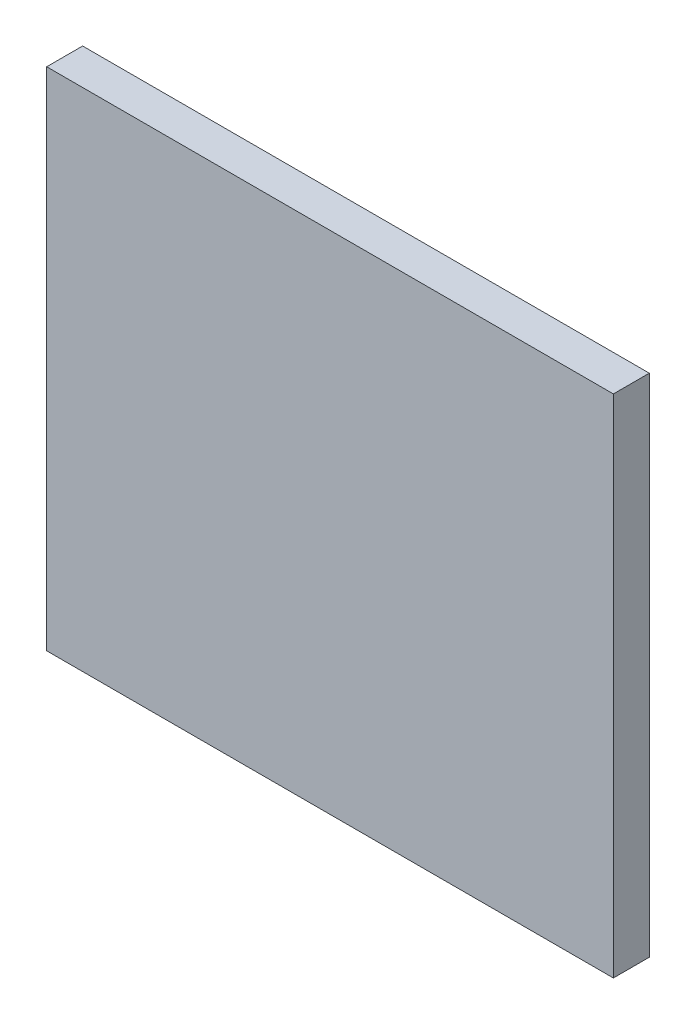
ISO-10303-21;
HEADER;
FILE_DESCRIPTION(('STEP AP214'),'2;1');
FILE_NAME('part.step','',(''),(''),'','','');
FILE_SCHEMA(('AUTOMOTIVE_DESIGN { 1 0 10303 214 1 1 1 1 }'));
ENDSEC;
DATA;
#1=APPLICATION_CONTEXT('core data for automotive mechanical design processes');
#2=APPLICATION_PROTOCOL_DEFINITION('international standard','automotive_design',2000,#1);
#3=PRODUCT_CONTEXT('',#1,'mechanical');
#4=PRODUCT('Part','Part','',(#3));
#5=PRODUCT_RELATED_PRODUCT_CATEGORY('part','',(#4));
#6=PRODUCT_DEFINITION_FORMATION('','',#4);
#7=PRODUCT_DEFINITION_CONTEXT('part definition',#1,'design');
#8=PRODUCT_DEFINITION('design','',#6,#7);
#9=PRODUCT_DEFINITION_SHAPE('','',#8);
#10=(LENGTH_UNIT() NAMED_UNIT(*) SI_UNIT(.MILLI.,.METRE.));
#11=(NAMED_UNIT(*) PLANE_ANGLE_UNIT() SI_UNIT($,.RADIAN.));
#12=(NAMED_UNIT(*) SI_UNIT($,.STERADIAN.) SOLID_ANGLE_UNIT());
#13=UNCERTAINTY_MEASURE_WITH_UNIT(LENGTH_MEASURE(1.E-05),#10,'distance_accuracy_value','');
#14=(GEOMETRIC_REPRESENTATION_CONTEXT(3) GLOBAL_UNCERTAINTY_ASSIGNED_CONTEXT((#13)) GLOBAL_UNIT_ASSIGNED_CONTEXT((#10,
#11,#12)) REPRESENTATION_CONTEXT('',''));
#15=CARTESIAN_POINT('',(0.,0.,0.));
#16=DIRECTION('',(0.,0.,1.));
#17=DIRECTION('',(1.,0.,0.));
#18=AXIS2_PLACEMENT_3D('',#15,#16,#17);
#19=CARTESIAN_POINT('',(-9.4615,8.4455,1.20000014));
#20=DIRECTION('',(0.,0.,1.));
#21=DIRECTION('',(1.,0.,0.));
#22=AXIS2_PLACEMENT_3D('',#19,#20,#21);
#23=PLANE('',#22);
#24=DIRECTION('',(0.,1.,0.));
#25=VECTOR('',#24,1.);
#26=CARTESIAN_POINT('',(9.4615,8.4455,1.20000014));
#27=LINE('',#26,#25);
#28=CARTESIAN_POINT('',(9.4615,8.4455,1.20000014));
#29=VERTEX_POINT('',#28);
#30=CARTESIAN_POINT('',(9.4615,-8.4455,1.20000014));
#31=VERTEX_POINT('',#30);
#32=EDGE_CURVE('E53',#29,#31,#27,.F.);
#33=ORIENTED_EDGE('',*,*,#32,.F.);
#34=DIRECTION('',(1.,0.,0.));
#35=VECTOR('',#34,1.);
#36=CARTESIAN_POINT('',(-9.4615,8.4455,1.20000014));
#37=LINE('',#36,#35);
#38=CARTESIAN_POINT('',(-9.4615,8.4455,1.20000014));
#39=VERTEX_POINT('',#38);
#40=EDGE_CURVE('E68',#39,#29,#37,.T.);
#41=ORIENTED_EDGE('',*,*,#40,.F.);
#42=DIRECTION('',(0.,1.,0.));
#43=VECTOR('',#42,1.);
#44=CARTESIAN_POINT('',(-9.4615,-8.4455,1.20000014));
#45=LINE('',#44,#43);
#46=CARTESIAN_POINT('',(-9.4615,-8.4455,1.20000014));
#47=VERTEX_POINT('',#46);
#48=EDGE_CURVE('E20',#47,#39,#45,.T.);
#49=ORIENTED_EDGE('',*,*,#48,.F.);
#50=DIRECTION('',(1.,0.,0.));
#51=VECTOR('',#50,1.);
#52=CARTESIAN_POINT('',(9.4615,-8.4455,1.20000014));
#53=LINE('',#52,#51);
#54=EDGE_CURVE('E58',#31,#47,#53,.F.);
#55=ORIENTED_EDGE('',*,*,#54,.F.);
#56=EDGE_LOOP('',(#33,#41,#49,#55));
#57=FACE_BOUND('',#56,.T.);
#58=ADVANCED_FACE('F17',(#57),#23,.T.);
#59=CARTESIAN_POINT('',(-9.4615,-8.4455,0.));
#60=DIRECTION('',(-1.,0.,0.));
#61=DIRECTION('',(0.,0.,1.));
#62=AXIS2_PLACEMENT_3D('',#59,#60,#61);
#63=PLANE('',#62);
#64=DIRECTION('',(0.,0.,1.));
#65=VECTOR('',#64,1.);
#66=CARTESIAN_POINT('',(-9.4615,8.4455,0.));
#67=LINE('',#66,#65);
#68=CARTESIAN_POINT('',(-9.4615,8.4455,0.));
#69=VERTEX_POINT('',#68);
#70=EDGE_CURVE('E79',#69,#39,#67,.T.);
#71=ORIENTED_EDGE('',*,*,#70,.F.);
#72=DIRECTION('',(0.,1.,0.));
#73=VECTOR('',#72,1.);
#74=CARTESIAN_POINT('',(-9.4615,8.4455,0.));
#75=LINE('',#74,#73);
#76=CARTESIAN_POINT('',(-9.4615,-8.4455,0.));
#77=VERTEX_POINT('',#76);
#78=EDGE_CURVE('E74',#69,#77,#75,.F.);
#79=ORIENTED_EDGE('',*,*,#78,.T.);
#80=DIRECTION('',(0.,0.,-1.));
#81=VECTOR('',#80,1.);
#82=CARTESIAN_POINT('',(-9.4615,-8.4455,0.));
#83=LINE('',#82,#81);
#84=EDGE_CURVE('E63',#47,#77,#83,.T.);
#85=ORIENTED_EDGE('',*,*,#84,.F.);
#86=ORIENTED_EDGE('',*,*,#48,.T.);
#87=EDGE_LOOP('',(#71,#79,#85,#86));
#88=FACE_BOUND('',#87,.T.);
#89=ADVANCED_FACE('F73',(#88),#63,.T.);
#90=CARTESIAN_POINT('',(9.4615,-8.4455,0.));
#91=DIRECTION('',(0.,-1.,0.));
#92=DIRECTION('',(0.,0.,-1.));
#93=AXIS2_PLACEMENT_3D('',#90,#91,#92);
#94=PLANE('',#93);
#95=ORIENTED_EDGE('',*,*,#84,.T.);
#96=DIRECTION('',(1.,0.,0.));
#97=VECTOR('',#96,1.);
#98=CARTESIAN_POINT('',(-9.4615,-8.4455,0.));
#99=LINE('',#98,#97);
#100=CARTESIAN_POINT('',(9.4615,-8.4455,0.));
#101=VERTEX_POINT('',#100);
#102=EDGE_CURVE('E84',#77,#101,#99,.T.);
#103=ORIENTED_EDGE('',*,*,#102,.T.);
#104=DIRECTION('',(0.,0.,-1.));
#105=VECTOR('',#104,1.);
#106=CARTESIAN_POINT('',(9.4615,-8.4455,0.));
#107=LINE('',#106,#105);
#108=EDGE_CURVE('E65',#31,#101,#107,.T.);
#109=ORIENTED_EDGE('',*,*,#108,.F.);
#110=ORIENTED_EDGE('',*,*,#54,.T.);
#111=EDGE_LOOP('',(#95,#103,#109,#110));
#112=FACE_BOUND('',#111,.T.);
#113=ADVANCED_FACE('F60',(#112),#94,.T.);
#114=CARTESIAN_POINT('',(9.4615,8.4455,0.));
#115=DIRECTION('',(1.,0.,0.));
#116=DIRECTION('',(0.,0.,-1.));
#117=AXIS2_PLACEMENT_3D('',#114,#115,#116);
#118=PLANE('',#117);
#119=ORIENTED_EDGE('',*,*,#108,.T.);
#120=DIRECTION('',(0.,1.,0.));
#121=VECTOR('',#120,1.);
#122=CARTESIAN_POINT('',(9.4615,8.4455,0.));
#123=LINE('',#122,#121);
#124=CARTESIAN_POINT('',(9.4615,8.4455,0.));
#125=VERTEX_POINT('',#124);
#126=EDGE_CURVE('E26',#101,#125,#123,.T.);
#127=ORIENTED_EDGE('',*,*,#126,.T.);
#128=DIRECTION('',(0.,0.,1.));
#129=VECTOR('',#128,1.);
#130=CARTESIAN_POINT('',(9.4615,8.4455,0.));
#131=LINE('',#130,#129);
#132=EDGE_CURVE('E34',#29,#125,#131,.F.);
#133=ORIENTED_EDGE('',*,*,#132,.F.);
#134=ORIENTED_EDGE('',*,*,#32,.T.);
#135=EDGE_LOOP('',(#119,#127,#133,#134));
#136=FACE_BOUND('',#135,.T.);
#137=ADVANCED_FACE('F88',(#136),#118,.T.);
#138=CARTESIAN_POINT('',(-9.4615,8.4455,0.));
#139=DIRECTION('',(0.,1.,0.));
#140=DIRECTION('',(0.,0.,1.));
#141=AXIS2_PLACEMENT_3D('',#138,#139,#140);
#142=PLANE('',#141);
#143=ORIENTED_EDGE('',*,*,#132,.T.);
#144=DIRECTION('',(1.,0.,0.));
#145=VECTOR('',#144,1.);
#146=CARTESIAN_POINT('',(-9.4615,8.4455,0.));
#147=LINE('',#146,#145);
#148=EDGE_CURVE('E11',#125,#69,#147,.F.);
#149=ORIENTED_EDGE('',*,*,#148,.T.);
#150=ORIENTED_EDGE('',*,*,#70,.T.);
#151=ORIENTED_EDGE('',*,*,#40,.T.);
#152=EDGE_LOOP('',(#143,#149,#150,#151));
#153=FACE_BOUND('',#152,.T.);
#154=ADVANCED_FACE('F91',(#153),#142,.T.);
#155=CARTESIAN_POINT('',(-9.4615,8.4455,0.));
#156=DIRECTION('',(0.,0.,1.));
#157=DIRECTION('',(1.,0.,0.));
#158=AXIS2_PLACEMENT_3D('',#155,#156,#157);
#159=PLANE('',#158);
#160=ORIENTED_EDGE('',*,*,#126,.F.);
#161=ORIENTED_EDGE('',*,*,#102,.F.);
#162=ORIENTED_EDGE('',*,*,#78,.F.);
#163=ORIENTED_EDGE('',*,*,#148,.F.);
#164=EDGE_LOOP('',(#160,#161,#162,#163));
#165=FACE_BOUND('',#164,.T.);
#166=ADVANCED_FACE('F90',(#165),#159,.F.);
#167=CLOSED_SHELL('',(#58,#89,#113,#137,#154,#166));
#168=MANIFOLD_SOLID_BREP('B1',#167);
#169=ADVANCED_BREP_SHAPE_REPRESENTATION('',(#18,#168),#14);
#170=SHAPE_DEFINITION_REPRESENTATION(#9,#169);
ENDSEC;
END-ISO-10303-21;
